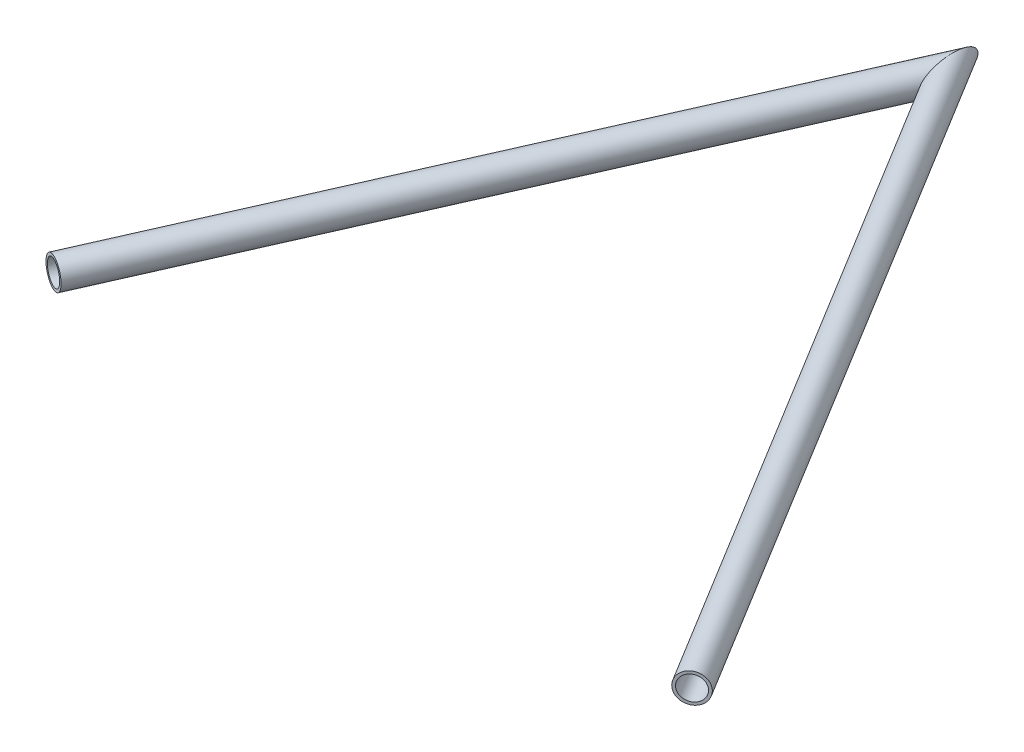
ISO-10303-21;
HEADER;
FILE_DESCRIPTION(('STEP AP214'),'2;1');
FILE_NAME('part.step','',(''),(''),'','','');
FILE_SCHEMA(('AUTOMOTIVE_DESIGN { 1 0 10303 214 1 1 1 1 }'));
ENDSEC;
DATA;
#1=APPLICATION_CONTEXT('core data for automotive mechanical design processes');
#2=APPLICATION_PROTOCOL_DEFINITION('international standard','automotive_design',2000,#1);
#3=PRODUCT_CONTEXT('',#1,'mechanical');
#4=PRODUCT('Part','Part','',(#3));
#5=PRODUCT_RELATED_PRODUCT_CATEGORY('part','',(#4));
#6=PRODUCT_DEFINITION_FORMATION('','',#4);
#7=PRODUCT_DEFINITION_CONTEXT('part definition',#1,'design');
#8=PRODUCT_DEFINITION('design','',#6,#7);
#9=PRODUCT_DEFINITION_SHAPE('','',#8);
#10=(LENGTH_UNIT() NAMED_UNIT(*) SI_UNIT(.MILLI.,.METRE.));
#11=(NAMED_UNIT(*) PLANE_ANGLE_UNIT() SI_UNIT($,.RADIAN.));
#12=(NAMED_UNIT(*) SI_UNIT($,.STERADIAN.) SOLID_ANGLE_UNIT());
#13=UNCERTAINTY_MEASURE_WITH_UNIT(LENGTH_MEASURE(1.E-05),#10,'distance_accuracy_value','');
#14=(GEOMETRIC_REPRESENTATION_CONTEXT(3) GLOBAL_UNCERTAINTY_ASSIGNED_CONTEXT((#13)) GLOBAL_UNIT_ASSIGNED_CONTEXT((#10,
#11,#12)) REPRESENTATION_CONTEXT('',''));
#15=CARTESIAN_POINT('',(0.,0.,0.));
#16=DIRECTION('',(0.,0.,1.));
#17=DIRECTION('',(1.,0.,0.));
#18=AXIS2_PLACEMENT_3D('',#15,#16,#17);
#19=CARTESIAN_POINT('',(0.,0.,0.));
#20=DIRECTION('',(0.522155689037339,0.,0.85285018403348));
#21=DIRECTION('',(0.852850184033481,0.,-0.522155689037339));
#22=AXIS2_PLACEMENT_3D('',#19,#20,#21);
#23=CYLINDRICAL_SURFACE('',#22,6.4643);
#24=CARTESIAN_POINT('',(217.552437831807,0.,355.333936864415));
#25=DIRECTION('',(-0.52215568903734,0.,-0.852850184033481));
#26=DIRECTION('',(-0.85285018403348,0.,0.522155689037339));
#27=AXIS2_PLACEMENT_3D('',#24,#25,#26);
#28=CIRCLE('',#27,6.4643);
#29=CARTESIAN_POINT('',(212.03935838716,0.,358.709307885059));
#30=VERTEX_POINT('',#29);
#31=EDGE_CURVE('E56',#30,#30,#28,.T.);
#32=ORIENTED_EDGE('',*,*,#31,.F.);
#33=EDGE_LOOP('',(#32));
#34=FACE_BOUND('',#33,.T.);
#35=CARTESIAN_POINT('',(0.,0.,0.));
#36=DIRECTION('',(-0.99778670803891,0.,0.0664957537055953));
#37=DIRECTION('',(0.0664957537055953,0.,0.99778670803891));
#38=AXIS2_PLACEMENT_3D('',#35,#36,#37);
#39=ELLIPSE('',#38,13.9230064534511,6.4643);
#40=CARTESIAN_POINT('',(0.925820807970099,0.,13.8921907751935));
#41=VERTEX_POINT('',#40);
#42=EDGE_CURVE('E52',#41,#41,#39,.T.);
#43=ORIENTED_EDGE('',*,*,#42,.T.);
#44=EDGE_LOOP('',(#43));
#45=FACE_BOUND('',#44,.T.);
#46=ADVANCED_FACE('F48',(#34,#45),#23,.F.);
#47=CARTESIAN_POINT('',(0.,0.,0.));
#48=DIRECTION('',(0.522155689037339,0.,0.85285018403348));
#49=DIRECTION('',(0.852850184033481,0.,-0.522155689037339));
#50=AXIS2_PLACEMENT_3D('',#47,#48,#49);
#51=CYLINDRICAL_SURFACE('',#50,7.9375);
#52=CARTESIAN_POINT('',(217.552437831807,0.,355.333936864415));
#53=DIRECTION('',(-0.52215568903734,0.,-0.852850184033481));
#54=DIRECTION('',(-0.85285018403348,0.,0.522155689037339));
#55=AXIS2_PLACEMENT_3D('',#52,#53,#54);
#56=CIRCLE('',#55,7.9375);
#57=CARTESIAN_POINT('',(210.782939496041,0.,359.478547646149));
#58=VERTEX_POINT('',#57);
#59=EDGE_CURVE('E60',#58,#58,#56,.T.);
#60=ORIENTED_EDGE('',*,*,#59,.T.);
#61=EDGE_LOOP('',(#60));
#62=FACE_BOUND('',#61,.T.);
#63=CARTESIAN_POINT('',(0.,0.,0.));
#64=DIRECTION('',(-0.99778670803891,0.,0.0664957537055953));
#65=DIRECTION('',(0.0664957537055953,0.,0.99778670803891));
#66=AXIS2_PLACEMENT_3D('',#63,#64,#65);
#67=ELLIPSE('',#66,17.0960295351806,7.9375);
#68=CARTESIAN_POINT('',(1.13681336931495,0.,17.0581910304439));
#69=VERTEX_POINT('',#68);
#70=EDGE_CURVE('E12',#69,#69,#67,.T.);
#71=ORIENTED_EDGE('',*,*,#70,.F.);
#72=EDGE_LOOP('',(#71));
#73=FACE_BOUND('',#72,.T.);
#74=ADVANCED_FACE('F75',(#62,#73),#51,.T.);
#75=CARTESIAN_POINT('',(217.552437831807,0.,355.333936864415));
#76=DIRECTION('',(-0.52215568903734,0.,-0.852850184033481));
#77=DIRECTION('',(-0.85285018403348,0.,0.522155689037339));
#78=AXIS2_PLACEMENT_3D('',#75,#76,#77);
#79=PLANE('',#78);
#80=ORIENTED_EDGE('',*,*,#31,.T.);
#81=EDGE_LOOP('',(#80));
#82=FACE_BOUND('',#81,.T.);
#83=ORIENTED_EDGE('',*,*,#59,.F.);
#84=EDGE_LOOP('',(#83));
#85=FACE_BOUND('',#84,.T.);
#86=ADVANCED_FACE('F71',(#82,#85),#79,.F.);
#87=CARTESIAN_POINT('',(0.,0.,0.));
#88=DIRECTION('',(-0.99778670803891,0.,0.0664957537055953));
#89=DIRECTION('',(0.0664957537055953,0.,0.99778670803891));
#90=AXIS2_PLACEMENT_3D('',#87,#88,#89);
#91=PLANE('',#90);
#92=ORIENTED_EDGE('',*,*,#42,.F.);
#93=EDGE_LOOP('',(#92));
#94=FACE_BOUND('',#93,.T.);
#95=ORIENTED_EDGE('',*,*,#70,.T.);
#96=EDGE_LOOP('',(#95));
#97=FACE_BOUND('',#96,.T.);
#98=ADVANCED_FACE('F50',(#94,#97),#91,.T.);
#99=CLOSED_SHELL('',(#46,#74,#86,#98));
#100=MANIFOLD_SOLID_BREP('B2',#99);
#101=CARTESIAN_POINT('',(-147.447562168193,0.,333.496452422721));
#102=DIRECTION('',(0.404367276866646,0.,-0.91459669002214));
#103=DIRECTION('',(-0.91459669002214,0.,-0.404367276866646));
#104=AXIS2_PLACEMENT_3D('',#101,#102,#103);
#105=CYLINDRICAL_SURFACE('',#104,6.4643);
#106=CARTESIAN_POINT('',(-147.447562168193,0.,333.496452422721));
#107=DIRECTION('',(-0.404367276866646,0.,0.91459669002214));
#108=DIRECTION('',(0.91459669002214,0.,0.404367276866646));
#109=AXIS2_PLACEMENT_3D('',#106,#107,#108);
#110=CIRCLE('',#109,6.4643);
#111=CARTESIAN_POINT('',(-141.535334784883,0.,336.110403810571));
#112=VERTEX_POINT('',#111);
#113=EDGE_CURVE('E146',#112,#112,#110,.T.);
#114=ORIENTED_EDGE('',*,*,#113,.T.);
#115=EDGE_LOOP('',(#114));
#116=FACE_BOUND('',#115,.T.);
#117=CARTESIAN_POINT('',(0.,0.,0.));
#118=DIRECTION('',(0.99778670803891,0.,-0.0664957537055954));
#119=DIRECTION('',(-0.0664957537055954,0.,-0.99778670803891));
#120=AXIS2_PLACEMENT_3D('',#117,#118,#119);
#121=ELLIPSE('',#120,13.9230064534511,6.4643);
#122=CARTESIAN_POINT('',(-0.925820807970101,0.,-13.8921907751935));
#123=VERTEX_POINT('',#122);
#124=EDGE_CURVE('E136',#123,#123,#121,.T.);
#125=ORIENTED_EDGE('',*,*,#124,.T.);
#126=EDGE_LOOP('',(#125));
#127=FACE_BOUND('',#126,.T.);
#128=ADVANCED_FACE('F132',(#116,#127),#105,.F.);
#129=CARTESIAN_POINT('',(-147.447562168193,0.,333.496452422721));
#130=DIRECTION('',(0.404367276866646,0.,-0.91459669002214));
#131=DIRECTION('',(-0.91459669002214,0.,-0.404367276866646));
#132=AXIS2_PLACEMENT_3D('',#129,#130,#131);
#133=CYLINDRICAL_SURFACE('',#132,7.9375);
#134=CARTESIAN_POINT('',(-147.447562168193,0.,333.496452422721));
#135=DIRECTION('',(-0.404367276866646,0.,0.91459669002214));
#136=DIRECTION('',(0.91459669002214,0.,0.404367276866646));
#137=AXIS2_PLACEMENT_3D('',#134,#135,#136);
#138=CIRCLE('',#137,7.9375);
#139=CARTESIAN_POINT('',(-140.187950941142,0.,336.70611768285));
#140=VERTEX_POINT('',#139);
#141=EDGE_CURVE('E140',#140,#140,#138,.T.);
#142=ORIENTED_EDGE('',*,*,#141,.F.);
#143=EDGE_LOOP('',(#142));
#144=FACE_BOUND('',#143,.T.);
#145=CARTESIAN_POINT('',(0.,0.,0.));
#146=DIRECTION('',(0.99778670803891,0.,-0.0664957537055954));
#147=DIRECTION('',(-0.0664957537055954,0.,-0.99778670803891));
#148=AXIS2_PLACEMENT_3D('',#145,#146,#147);
#149=ELLIPSE('',#148,17.0960295351806,7.9375);
#150=CARTESIAN_POINT('',(-1.13681336931496,0.,-17.0581910304439));
#151=VERTEX_POINT('',#150);
#152=EDGE_CURVE('E47',#151,#151,#149,.T.);
#153=ORIENTED_EDGE('',*,*,#152,.F.);
#154=EDGE_LOOP('',(#153));
#155=FACE_BOUND('',#154,.T.);
#156=ADVANCED_FACE('F159',(#144,#155),#133,.T.);
#157=CARTESIAN_POINT('',(-147.447562168193,0.,333.496452422721));
#158=DIRECTION('',(-0.404367276866646,0.,0.91459669002214));
#159=DIRECTION('',(0.91459669002214,0.,0.404367276866646));
#160=AXIS2_PLACEMENT_3D('',#157,#158,#159);
#161=PLANE('',#160);
#162=ORIENTED_EDGE('',*,*,#113,.F.);
#163=EDGE_LOOP('',(#162));
#164=FACE_BOUND('',#163,.T.);
#165=ORIENTED_EDGE('',*,*,#141,.T.);
#166=EDGE_LOOP('',(#165));
#167=FACE_BOUND('',#166,.T.);
#168=ADVANCED_FACE('F155',(#164,#167),#161,.T.);
#169=CARTESIAN_POINT('',(0.,0.,0.));
#170=DIRECTION('',(0.99778670803891,0.,-0.0664957537055954));
#171=DIRECTION('',(-0.0664957537055954,0.,-0.99778670803891));
#172=AXIS2_PLACEMENT_3D('',#169,#170,#171);
#173=PLANE('',#172);
#174=ORIENTED_EDGE('',*,*,#124,.F.);
#175=EDGE_LOOP('',(#174));
#176=FACE_BOUND('',#175,.T.);
#177=ORIENTED_EDGE('',*,*,#152,.T.);
#178=EDGE_LOOP('',(#177));
#179=FACE_BOUND('',#178,.T.);
#180=ADVANCED_FACE('F134',(#176,#179),#173,.T.);
#181=CLOSED_SHELL('',(#128,#156,#168,#180));
#182=MANIFOLD_SOLID_BREP('B7',#181);
#183=ADVANCED_BREP_SHAPE_REPRESENTATION('',(#18,#100,#182),#14);
#184=SHAPE_DEFINITION_REPRESENTATION(#9,#183);
ENDSEC;
END-ISO-10303-21;
